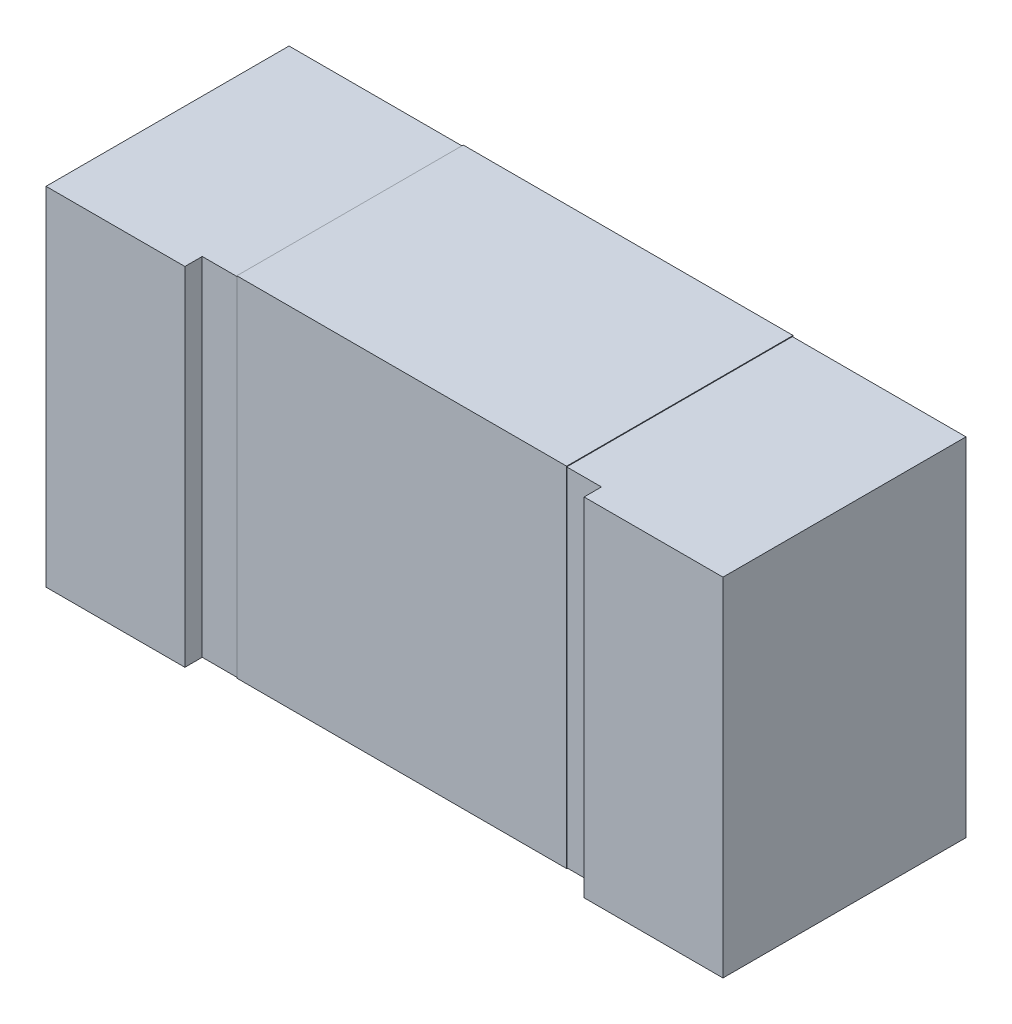
ISO-10303-21;
HEADER;
FILE_DESCRIPTION(('STEP AP214'),'2;1');
FILE_NAME('part.step','',(''),(''),'','','');
FILE_SCHEMA(('AUTOMOTIVE_DESIGN { 1 0 10303 214 1 1 1 1 }'));
ENDSEC;
DATA;
#1=APPLICATION_CONTEXT('core data for automotive mechanical design processes');
#2=APPLICATION_PROTOCOL_DEFINITION('international standard','automotive_design',2000,#1);
#3=PRODUCT_CONTEXT('',#1,'mechanical');
#4=PRODUCT('Part','Part','',(#3));
#5=PRODUCT_RELATED_PRODUCT_CATEGORY('part','',(#4));
#6=PRODUCT_DEFINITION_FORMATION('','',#4);
#7=PRODUCT_DEFINITION_CONTEXT('part definition',#1,'design');
#8=PRODUCT_DEFINITION('design','',#6,#7);
#9=PRODUCT_DEFINITION_SHAPE('','',#8);
#10=(LENGTH_UNIT() NAMED_UNIT(*) SI_UNIT(.MILLI.,.METRE.));
#11=(NAMED_UNIT(*) PLANE_ANGLE_UNIT() SI_UNIT($,.RADIAN.));
#12=(NAMED_UNIT(*) SI_UNIT($,.STERADIAN.) SOLID_ANGLE_UNIT());
#13=UNCERTAINTY_MEASURE_WITH_UNIT(LENGTH_MEASURE(1.E-05),#10,'distance_accuracy_value','');
#14=(GEOMETRIC_REPRESENTATION_CONTEXT(3) GLOBAL_UNCERTAINTY_ASSIGNED_CONTEXT((#13)) GLOBAL_UNIT_ASSIGNED_CONTEXT((#10,
#11,#12)) REPRESENTATION_CONTEXT('',''));
#15=CARTESIAN_POINT('',(0.,0.,0.));
#16=DIRECTION('',(0.,0.,1.));
#17=DIRECTION('',(1.,0.,0.));
#18=AXIS2_PLACEMENT_3D('',#15,#16,#17);
#19=CARTESIAN_POINT('',(-0.4699,-0.254,0.3302));
#20=DIRECTION('',(0.,0.,1.));
#21=DIRECTION('',(1.,0.,0.));
#22=AXIS2_PLACEMENT_3D('',#19,#20,#21);
#23=PLANE('',#22);
#24=DIRECTION('',(1.,0.,0.));
#25=VECTOR('',#24,1.);
#26=CARTESIAN_POINT('',(-0.4699,0.254,0.3302));
#27=LINE('',#26,#25);
#28=CARTESIAN_POINT('',(0.2413,0.254,0.3302));
#29=VERTEX_POINT('',#28);
#30=CARTESIAN_POINT('',(0.2921,0.254,0.3302));
#31=VERTEX_POINT('',#30);
#32=EDGE_CURVE('E228',#29,#31,#27,.T.);
#33=ORIENTED_EDGE('',*,*,#32,.F.);
#34=DIRECTION('',(0.,-1.,0.));
#35=VECTOR('',#34,1.);
#36=CARTESIAN_POINT('',(0.2413,-0.254,0.3302));
#37=LINE('',#36,#35);
#38=CARTESIAN_POINT('',(0.2413,-0.254,0.3302));
#39=VERTEX_POINT('',#38);
#40=EDGE_CURVE('E173',#29,#39,#37,.T.);
#41=ORIENTED_EDGE('',*,*,#40,.T.);
#42=DIRECTION('',(1.,0.,0.));
#43=VECTOR('',#42,1.);
#44=CARTESIAN_POINT('',(-0.4699,-0.254,0.3302));
#45=LINE('',#44,#43);
#46=CARTESIAN_POINT('',(0.2921,-0.254,0.3302));
#47=VERTEX_POINT('',#46);
#48=EDGE_CURVE('E233',#39,#47,#45,.T.);
#49=ORIENTED_EDGE('',*,*,#48,.T.);
#50=DIRECTION('',(0.,-1.,0.));
#51=VECTOR('',#50,1.);
#52=CARTESIAN_POINT('',(0.2921,0.254,0.3302));
#53=LINE('',#52,#51);
#54=EDGE_CURVE('E219',#31,#47,#53,.T.);
#55=ORIENTED_EDGE('',*,*,#54,.F.);
#56=EDGE_LOOP('',(#33,#41,#49,#55));
#57=FACE_BOUND('',#56,.T.);
#58=ADVANCED_FACE('F35',(#57),#23,.T.);
#59=CARTESIAN_POINT('',(0.,0.254,0.));
#60=DIRECTION('',(0.,-1.,0.));
#61=DIRECTION('',(0.,0.,-1.));
#62=AXIS2_PLACEMENT_3D('',#59,#60,#61);
#63=PLANE('',#62);
#64=DIRECTION('',(0.,0.,1.));
#65=VECTOR('',#64,1.);
#66=CARTESIAN_POINT('',(0.2413,0.254,0.));
#67=LINE('',#66,#65);
#68=CARTESIAN_POINT('',(0.2413,0.254,0.));
#69=VERTEX_POINT('',#68);
#70=EDGE_CURVE('E50',#69,#29,#67,.T.);
#71=ORIENTED_EDGE('',*,*,#70,.T.);
#72=ORIENTED_EDGE('',*,*,#32,.T.);
#73=DIRECTION('',(0.,0.,1.));
#74=VECTOR('',#73,1.);
#75=CARTESIAN_POINT('',(0.2921,0.254,0.3302));
#76=LINE('',#75,#74);
#77=CARTESIAN_POINT('',(0.2921,0.254,0.3556));
#78=VERTEX_POINT('',#77);
#79=EDGE_CURVE('E199',#31,#78,#76,.T.);
#80=ORIENTED_EDGE('',*,*,#79,.T.);
#81=DIRECTION('',(1.,0.,0.));
#82=VECTOR('',#81,1.);
#83=CARTESIAN_POINT('',(0.2921,0.254,0.3556));
#84=LINE('',#83,#82);
#85=CARTESIAN_POINT('',(0.4953,0.254,0.3556));
#86=VERTEX_POINT('',#85);
#87=EDGE_CURVE('E201',#78,#86,#84,.T.);
#88=ORIENTED_EDGE('',*,*,#87,.T.);
#89=DIRECTION('',(0.,0.,-1.));
#90=VECTOR('',#89,1.);
#91=CARTESIAN_POINT('',(0.4953,0.254,0.3556));
#92=LINE('',#91,#90);
#93=CARTESIAN_POINT('',(0.4953,0.254,0.));
#94=VERTEX_POINT('',#93);
#95=EDGE_CURVE('E192',#86,#94,#92,.T.);
#96=ORIENTED_EDGE('',*,*,#95,.T.);
#97=DIRECTION('',(-1.,0.,0.));
#98=VECTOR('',#97,1.);
#99=CARTESIAN_POINT('',(0.4953,0.254,0.));
#100=LINE('',#99,#98);
#101=EDGE_CURVE('E195',#94,#69,#100,.T.);
#102=ORIENTED_EDGE('',*,*,#101,.T.);
#103=EDGE_LOOP('',(#71,#72,#80,#88,#96,#102));
#104=FACE_BOUND('',#103,.T.);
#105=ADVANCED_FACE('F306',(#104),#63,.F.);
#106=CARTESIAN_POINT('',(0.,-0.254,0.));
#107=DIRECTION('',(0.,-1.,0.));
#108=DIRECTION('',(0.,0.,-1.));
#109=AXIS2_PLACEMENT_3D('',#106,#107,#108);
#110=PLANE('',#109);
#111=ORIENTED_EDGE('',*,*,#48,.F.);
#112=DIRECTION('',(0.,0.,1.));
#113=VECTOR('',#112,1.);
#114=CARTESIAN_POINT('',(0.2413,-0.254,0.));
#115=LINE('',#114,#113);
#116=CARTESIAN_POINT('',(0.2413,-0.254,0.));
#117=VERTEX_POINT('',#116);
#118=EDGE_CURVE('E209',#117,#39,#115,.T.);
#119=ORIENTED_EDGE('',*,*,#118,.F.);
#120=DIRECTION('',(-1.,0.,0.));
#121=VECTOR('',#120,1.);
#122=CARTESIAN_POINT('',(0.4953,-0.254,0.));
#123=LINE('',#122,#121);
#124=CARTESIAN_POINT('',(0.4953,-0.254,0.));
#125=VERTEX_POINT('',#124);
#126=EDGE_CURVE('E206',#125,#117,#123,.T.);
#127=ORIENTED_EDGE('',*,*,#126,.F.);
#128=DIRECTION('',(0.,0.,-1.));
#129=VECTOR('',#128,1.);
#130=CARTESIAN_POINT('',(0.4953,-0.254,0.3556));
#131=LINE('',#130,#129);
#132=CARTESIAN_POINT('',(0.4953,-0.254,0.3556));
#133=VERTEX_POINT('',#132);
#134=EDGE_CURVE('E191',#133,#125,#131,.T.);
#135=ORIENTED_EDGE('',*,*,#134,.F.);
#136=DIRECTION('',(1.,0.,0.));
#137=VECTOR('',#136,1.);
#138=CARTESIAN_POINT('',(0.2921,-0.254,0.3556));
#139=LINE('',#138,#137);
#140=CARTESIAN_POINT('',(0.2921,-0.254,0.3556));
#141=VERTEX_POINT('',#140);
#142=EDGE_CURVE('E196',#141,#133,#139,.T.);
#143=ORIENTED_EDGE('',*,*,#142,.F.);
#144=DIRECTION('',(0.,0.,1.));
#145=VECTOR('',#144,1.);
#146=CARTESIAN_POINT('',(0.2921,-0.254,0.3302));
#147=LINE('',#146,#145);
#148=EDGE_CURVE('E211',#47,#141,#147,.T.);
#149=ORIENTED_EDGE('',*,*,#148,.F.);
#150=EDGE_LOOP('',(#111,#119,#127,#135,#143,#149));
#151=FACE_BOUND('',#150,.T.);
#152=ADVANCED_FACE('F312',(#151),#110,.T.);
#153=CARTESIAN_POINT('',(0.4953,0.254,0.3556));
#154=DIRECTION('',(-1.,0.,0.));
#155=DIRECTION('',(0.,0.,1.));
#156=AXIS2_PLACEMENT_3D('',#153,#154,#155);
#157=PLANE('',#156);
#158=ORIENTED_EDGE('',*,*,#134,.T.);
#159=DIRECTION('',(0.,-1.,0.));
#160=VECTOR('',#159,1.);
#161=CARTESIAN_POINT('',(0.4953,0.254,0.));
#162=LINE('',#161,#160);
#163=EDGE_CURVE('E225',#94,#125,#162,.T.);
#164=ORIENTED_EDGE('',*,*,#163,.F.);
#165=ORIENTED_EDGE('',*,*,#95,.F.);
#166=DIRECTION('',(0.,-1.,0.));
#167=VECTOR('',#166,1.);
#168=CARTESIAN_POINT('',(0.4953,0.254,0.3556));
#169=LINE('',#168,#167);
#170=EDGE_CURVE('E203',#86,#133,#169,.T.);
#171=ORIENTED_EDGE('',*,*,#170,.T.);
#172=EDGE_LOOP('',(#158,#164,#165,#171));
#173=FACE_BOUND('',#172,.T.);
#174=ADVANCED_FACE('F328',(#173),#157,.F.);
#175=CARTESIAN_POINT('',(0.4953,0.254,0.));
#176=DIRECTION('',(0.,0.,1.));
#177=DIRECTION('',(1.,0.,0.));
#178=AXIS2_PLACEMENT_3D('',#175,#176,#177);
#179=PLANE('',#178);
#180=ORIENTED_EDGE('',*,*,#126,.T.);
#181=DIRECTION('',(0.,-1.,0.));
#182=VECTOR('',#181,1.);
#183=CARTESIAN_POINT('',(0.2413,0.254,0.));
#184=LINE('',#183,#182);
#185=EDGE_CURVE('E222',#69,#117,#184,.T.);
#186=ORIENTED_EDGE('',*,*,#185,.F.);
#187=ORIENTED_EDGE('',*,*,#101,.F.);
#188=ORIENTED_EDGE('',*,*,#163,.T.);
#189=EDGE_LOOP('',(#180,#186,#187,#188));
#190=FACE_BOUND('',#189,.T.);
#191=ADVANCED_FACE('F333',(#190),#179,.F.);
#192=CARTESIAN_POINT('',(0.2921,0.254,0.3302));
#193=DIRECTION('',(1.,0.,0.));
#194=DIRECTION('',(0.,0.,-1.));
#195=AXIS2_PLACEMENT_3D('',#192,#193,#194);
#196=PLANE('',#195);
#197=ORIENTED_EDGE('',*,*,#148,.T.);
#198=DIRECTION('',(0.,-1.,0.));
#199=VECTOR('',#198,1.);
#200=CARTESIAN_POINT('',(0.2921,0.254,0.3556));
#201=LINE('',#200,#199);
#202=EDGE_CURVE('E216',#78,#141,#201,.T.);
#203=ORIENTED_EDGE('',*,*,#202,.F.);
#204=ORIENTED_EDGE('',*,*,#79,.F.);
#205=ORIENTED_EDGE('',*,*,#54,.T.);
#206=EDGE_LOOP('',(#197,#203,#204,#205));
#207=FACE_BOUND('',#206,.T.);
#208=ADVANCED_FACE('F302',(#207),#196,.F.);
#209=CARTESIAN_POINT('',(0.2921,0.254,0.3556));
#210=DIRECTION('',(0.,0.,-1.));
#211=DIRECTION('',(-1.,0.,0.));
#212=AXIS2_PLACEMENT_3D('',#209,#210,#211);
#213=PLANE('',#212);
#214=ORIENTED_EDGE('',*,*,#142,.T.);
#215=ORIENTED_EDGE('',*,*,#170,.F.);
#216=ORIENTED_EDGE('',*,*,#87,.F.);
#217=ORIENTED_EDGE('',*,*,#202,.T.);
#218=EDGE_LOOP('',(#214,#215,#216,#217));
#219=FACE_BOUND('',#218,.T.);
#220=ADVANCED_FACE('F293',(#219),#213,.F.);
#221=CARTESIAN_POINT('',(-0.2413,0.254,0.));
#222=DIRECTION('',(-1.,0.,0.));
#223=DIRECTION('',(0.,0.,1.));
#224=AXIS2_PLACEMENT_3D('',#221,#222,#223);
#225=PLANE('',#224);
#226=DIRECTION('',(0.,0.,-1.));
#227=VECTOR('',#226,1.);
#228=CARTESIAN_POINT('',(-0.2413,0.255,-0.00099999999999994));
#229=LINE('',#228,#227);
#230=CARTESIAN_POINT('',(-0.2413,0.255,0.330359425168108));
#231=VERTEX_POINT('',#230);
#232=CARTESIAN_POINT('',(-0.2413,0.255,-0.00099999999999994));
#233=VERTEX_POINT('',#232);
#234=EDGE_CURVE('E162',#231,#233,#229,.T.);
#235=ORIENTED_EDGE('',*,*,#234,.T.);
#236=DIRECTION('',(0.,-1.,0.));
#237=VECTOR('',#236,1.);
#238=CARTESIAN_POINT('',(-0.2413,0.255,-0.00099999999999994));
#239=LINE('',#238,#237);
#240=CARTESIAN_POINT('',(-0.2413,-0.255,-0.000999999999999877));
#241=VERTEX_POINT('',#240);
#242=EDGE_CURVE('E168',#233,#241,#239,.T.);
#243=ORIENTED_EDGE('',*,*,#242,.T.);
#244=DIRECTION('',(0.,0.,1.));
#245=VECTOR('',#244,1.);
#246=CARTESIAN_POINT('',(-0.2413,-0.255,-0.000999999999999877));
#247=LINE('',#246,#245);
#248=CARTESIAN_POINT('',(-0.2413,-0.255,0.330359425168108));
#249=VERTEX_POINT('',#248);
#250=EDGE_CURVE('E172',#241,#249,#247,.T.);
#251=ORIENTED_EDGE('',*,*,#250,.T.);
#252=DIRECTION('',(0.,1.,0.));
#253=VECTOR('',#252,1.);
#254=CARTESIAN_POINT('',(-0.2413,0.255,0.330359425168108));
#255=LINE('',#254,#253);
#256=EDGE_CURVE('E152',#249,#231,#255,.T.);
#257=ORIENTED_EDGE('',*,*,#256,.T.);
#258=EDGE_LOOP('',(#235,#243,#251,#257));
#259=FACE_BOUND('',#258,.T.);
#260=DIRECTION('',(0.,0.,-1.));
#261=VECTOR('',#260,1.);
#262=CARTESIAN_POINT('',(-0.2413,0.254,0.));
#263=LINE('',#262,#261);
#264=CARTESIAN_POINT('',(-0.2413,0.254,0.3302));
#265=VERTEX_POINT('',#264);
#266=CARTESIAN_POINT('',(-0.2413,0.254,0.));
#267=VERTEX_POINT('',#266);
#268=EDGE_CURVE('E58',#265,#267,#263,.T.);
#269=ORIENTED_EDGE('',*,*,#268,.F.);
#270=DIRECTION('',(0.,-1.,0.));
#271=VECTOR('',#270,1.);
#272=CARTESIAN_POINT('',(-0.2413,-0.254,0.3302));
#273=LINE('',#272,#271);
#274=CARTESIAN_POINT('',(-0.2413,-0.254,0.3302));
#275=VERTEX_POINT('',#274);
#276=EDGE_CURVE('E176',#265,#275,#273,.T.);
#277=ORIENTED_EDGE('',*,*,#276,.T.);
#278=DIRECTION('',(0.,0.,-1.));
#279=VECTOR('',#278,1.);
#280=CARTESIAN_POINT('',(-0.2413,-0.254,0.));
#281=LINE('',#280,#279);
#282=CARTESIAN_POINT('',(-0.2413,-0.254,0.));
#283=VERTEX_POINT('',#282);
#284=EDGE_CURVE('E241',#275,#283,#281,.T.);
#285=ORIENTED_EDGE('',*,*,#284,.T.);
#286=DIRECTION('',(0.,-1.,0.));
#287=VECTOR('',#286,1.);
#288=CARTESIAN_POINT('',(-0.2413,0.254,0.));
#289=LINE('',#288,#287);
#290=EDGE_CURVE('E248',#267,#283,#289,.T.);
#291=ORIENTED_EDGE('',*,*,#290,.F.);
#292=EDGE_LOOP('',(#269,#277,#285,#291));
#293=FACE_BOUND('',#292,.T.);
#294=ADVANCED_FACE('F171',(#259,#293),#225,.T.);
#295=CARTESIAN_POINT('',(-0.849493282310598,0.255,-0.00099999999999994));
#296=DIRECTION('',(0.,0.,1.));
#297=DIRECTION('',(0.,-1.,0.));
#298=AXIS2_PLACEMENT_3D('',#295,#296,#297);
#299=PLANE('',#298);
#300=ORIENTED_EDGE('',*,*,#242,.F.);
#301=DIRECTION('',(1.,0.,0.));
#302=VECTOR('',#301,1.);
#303=CARTESIAN_POINT('',(-0.849493282310598,0.255,-0.00099999999999994));
#304=LINE('',#303,#302);
#305=CARTESIAN_POINT('',(0.2413,0.255,-0.00099999999999994));
#306=VERTEX_POINT('',#305);
#307=EDGE_CURVE('E164',#233,#306,#304,.T.);
#308=ORIENTED_EDGE('',*,*,#307,.T.);
#309=DIRECTION('',(0.,-1.,0.));
#310=VECTOR('',#309,1.);
#311=CARTESIAN_POINT('',(0.2413,0.255,-0.00099999999999994));
#312=LINE('',#311,#310);
#313=CARTESIAN_POINT('',(0.2413,-0.255,-0.000999999999999877));
#314=VERTEX_POINT('',#313);
#315=EDGE_CURVE('E180',#306,#314,#312,.T.);
#316=ORIENTED_EDGE('',*,*,#315,.T.);
#317=DIRECTION('',(1.,0.,0.));
#318=VECTOR('',#317,1.);
#319=CARTESIAN_POINT('',(-0.849493282310598,-0.255,-0.000999999999999877));
#320=LINE('',#319,#318);
#321=EDGE_CURVE('E184',#241,#314,#320,.T.);
#322=ORIENTED_EDGE('',*,*,#321,.F.);
#323=EDGE_LOOP('',(#300,#308,#316,#322));
#324=FACE_BOUND('',#323,.T.);
#325=ADVANCED_FACE('F292',(#324),#299,.F.);
#326=CARTESIAN_POINT('',(-0.849493282310598,-0.255,-0.000999999999999877));
#327=DIRECTION('',(0.,1.,0.));
#328=DIRECTION('',(0.,0.,1.));
#329=AXIS2_PLACEMENT_3D('',#326,#327,#328);
#330=PLANE('',#329);
#331=ORIENTED_EDGE('',*,*,#250,.F.);
#332=ORIENTED_EDGE('',*,*,#321,.T.);
#333=DIRECTION('',(0.,0.,1.));
#334=VECTOR('',#333,1.);
#335=CARTESIAN_POINT('',(0.2413,-0.255,-0.000999999999999877));
#336=LINE('',#335,#334);
#337=CARTESIAN_POINT('',(0.2413,-0.255,0.330359425168108));
#338=VERTEX_POINT('',#337);
#339=EDGE_CURVE('E186',#314,#338,#336,.T.);
#340=ORIENTED_EDGE('',*,*,#339,.T.);
#341=DIRECTION('',(1.,0.,0.));
#342=VECTOR('',#341,1.);
#343=CARTESIAN_POINT('',(-0.849493282310598,-0.255,0.330359425168108));
#344=LINE('',#343,#342);
#345=EDGE_CURVE('E187',#249,#338,#344,.T.);
#346=ORIENTED_EDGE('',*,*,#345,.F.);
#347=EDGE_LOOP('',(#331,#332,#340,#346));
#348=FACE_BOUND('',#347,.T.);
#349=ADVANCED_FACE('F299',(#348),#330,.F.);
#350=CARTESIAN_POINT('',(-0.849493282310598,0.255,0.330359425168108));
#351=DIRECTION('',(0.,0.,-1.));
#352=DIRECTION('',(0.,1.,0.));
#353=AXIS2_PLACEMENT_3D('',#350,#351,#352);
#354=PLANE('',#353);
#355=ORIENTED_EDGE('',*,*,#256,.F.);
#356=ORIENTED_EDGE('',*,*,#345,.T.);
#357=DIRECTION('',(0.,1.,0.));
#358=VECTOR('',#357,1.);
#359=CARTESIAN_POINT('',(0.2413,0.255,0.330359425168108));
#360=LINE('',#359,#358);
#361=CARTESIAN_POINT('',(0.2413,0.255,0.330359425168108));
#362=VERTEX_POINT('',#361);
#363=EDGE_CURVE('E155',#338,#362,#360,.T.);
#364=ORIENTED_EDGE('',*,*,#363,.T.);
#365=DIRECTION('',(1.,0.,0.));
#366=VECTOR('',#365,1.);
#367=CARTESIAN_POINT('',(-0.849493282310598,0.255,0.330359425168108));
#368=LINE('',#367,#366);
#369=EDGE_CURVE('E148',#231,#362,#368,.T.);
#370=ORIENTED_EDGE('',*,*,#369,.F.);
#371=EDGE_LOOP('',(#355,#356,#364,#370));
#372=FACE_BOUND('',#371,.T.);
#373=ADVANCED_FACE('F150',(#372),#354,.F.);
#374=CARTESIAN_POINT('',(-0.849493282310598,0.255,-0.00099999999999994));
#375=DIRECTION('',(0.,-1.,0.));
#376=DIRECTION('',(0.,0.,-1.));
#377=AXIS2_PLACEMENT_3D('',#374,#375,#376);
#378=PLANE('',#377);
#379=ORIENTED_EDGE('',*,*,#234,.F.);
#380=ORIENTED_EDGE('',*,*,#369,.T.);
#381=DIRECTION('',(0.,0.,-1.));
#382=VECTOR('',#381,1.);
#383=CARTESIAN_POINT('',(0.2413,0.255,-0.00099999999999994));
#384=LINE('',#383,#382);
#385=EDGE_CURVE('E159',#362,#306,#384,.T.);
#386=ORIENTED_EDGE('',*,*,#385,.T.);
#387=ORIENTED_EDGE('',*,*,#307,.F.);
#388=EDGE_LOOP('',(#379,#380,#386,#387));
#389=FACE_BOUND('',#388,.T.);
#390=ADVANCED_FACE('F163',(#389),#378,.F.);
#391=CARTESIAN_POINT('',(0.2413,0.,0.));
#392=DIRECTION('',(-1.,0.,0.));
#393=DIRECTION('',(0.,0.,1.));
#394=AXIS2_PLACEMENT_3D('',#391,#392,#393);
#395=PLANE('',#394);
#396=ORIENTED_EDGE('',*,*,#40,.F.);
#397=ORIENTED_EDGE('',*,*,#70,.F.);
#398=ORIENTED_EDGE('',*,*,#185,.T.);
#399=ORIENTED_EDGE('',*,*,#118,.T.);
#400=EDGE_LOOP('',(#396,#397,#398,#399));
#401=FACE_BOUND('',#400,.T.);
#402=ORIENTED_EDGE('',*,*,#315,.F.);
#403=ORIENTED_EDGE('',*,*,#385,.F.);
#404=ORIENTED_EDGE('',*,*,#363,.F.);
#405=ORIENTED_EDGE('',*,*,#339,.F.);
#406=EDGE_LOOP('',(#402,#403,#404,#405));
#407=FACE_BOUND('',#406,.T.);
#408=ADVANCED_FACE('F346',(#401,#407),#395,.F.);
#409=CARTESIAN_POINT('',(-0.4953,0.254,0.3556));
#410=DIRECTION('',(1.,0.,0.));
#411=DIRECTION('',(0.,0.,-1.));
#412=AXIS2_PLACEMENT_3D('',#409,#410,#411);
#413=PLANE('',#412);
#414=DIRECTION('',(0.,0.,1.));
#415=VECTOR('',#414,1.);
#416=CARTESIAN_POINT('',(-0.4953,-0.254,0.3556));
#417=LINE('',#416,#415);
#418=CARTESIAN_POINT('',(-0.4953,-0.254,0.));
#419=VERTEX_POINT('',#418);
#420=CARTESIAN_POINT('',(-0.4953,-0.254,0.3556));
#421=VERTEX_POINT('',#420);
#422=EDGE_CURVE('E251',#419,#421,#417,.T.);
#423=ORIENTED_EDGE('',*,*,#422,.T.);
#424=DIRECTION('',(0.,-1.,0.));
#425=VECTOR('',#424,1.);
#426=CARTESIAN_POINT('',(-0.4953,0.254,0.3556));
#427=LINE('',#426,#425);
#428=CARTESIAN_POINT('',(-0.4953,0.254,0.3556));
#429=VERTEX_POINT('',#428);
#430=EDGE_CURVE('E43',#429,#421,#427,.T.);
#431=ORIENTED_EDGE('',*,*,#430,.F.);
#432=DIRECTION('',(0.,0.,1.));
#433=VECTOR('',#432,1.);
#434=CARTESIAN_POINT('',(-0.4953,0.254,0.3556));
#435=LINE('',#434,#433);
#436=CARTESIAN_POINT('',(-0.4953,0.254,0.));
#437=VERTEX_POINT('',#436);
#438=EDGE_CURVE('E240',#437,#429,#435,.T.);
#439=ORIENTED_EDGE('',*,*,#438,.F.);
#440=DIRECTION('',(0.,-1.,0.));
#441=VECTOR('',#440,1.);
#442=CARTESIAN_POINT('',(-0.4953,0.254,0.));
#443=LINE('',#442,#441);
#444=EDGE_CURVE('E11',#437,#419,#443,.T.);
#445=ORIENTED_EDGE('',*,*,#444,.T.);
#446=EDGE_LOOP('',(#423,#431,#439,#445));
#447=FACE_BOUND('',#446,.T.);
#448=ADVANCED_FACE('F289',(#447),#413,.F.);
#449=CARTESIAN_POINT('',(-0.2921,0.254,0.3556));
#450=DIRECTION('',(0.,0.,-1.));
#451=DIRECTION('',(-1.,0.,0.));
#452=AXIS2_PLACEMENT_3D('',#449,#450,#451);
#453=PLANE('',#452);
#454=DIRECTION('',(1.,0.,0.));
#455=VECTOR('',#454,1.);
#456=CARTESIAN_POINT('',(-0.2921,-0.254,0.3556));
#457=LINE('',#456,#455);
#458=CARTESIAN_POINT('',(-0.2921,-0.254,0.3556));
#459=VERTEX_POINT('',#458);
#460=EDGE_CURVE('E253',#421,#459,#457,.T.);
#461=ORIENTED_EDGE('',*,*,#460,.T.);
#462=DIRECTION('',(0.,-1.,0.));
#463=VECTOR('',#462,1.);
#464=CARTESIAN_POINT('',(-0.2921,0.254,0.3556));
#465=LINE('',#464,#463);
#466=CARTESIAN_POINT('',(-0.2921,0.254,0.3556));
#467=VERTEX_POINT('',#466);
#468=EDGE_CURVE('E264',#467,#459,#465,.T.);
#469=ORIENTED_EDGE('',*,*,#468,.F.);
#470=DIRECTION('',(1.,0.,0.));
#471=VECTOR('',#470,1.);
#472=CARTESIAN_POINT('',(-0.2921,0.254,0.3556));
#473=LINE('',#472,#471);
#474=EDGE_CURVE('E243',#429,#467,#473,.T.);
#475=ORIENTED_EDGE('',*,*,#474,.F.);
#476=ORIENTED_EDGE('',*,*,#430,.T.);
#477=EDGE_LOOP('',(#461,#469,#475,#476));
#478=FACE_BOUND('',#477,.T.);
#479=ADVANCED_FACE('F271',(#478),#453,.F.);
#480=CARTESIAN_POINT('',(-0.2921,0.254,0.3302));
#481=DIRECTION('',(-1.,0.,0.));
#482=DIRECTION('',(0.,0.,1.));
#483=AXIS2_PLACEMENT_3D('',#480,#481,#482);
#484=PLANE('',#483);
#485=DIRECTION('',(0.,0.,-1.));
#486=VECTOR('',#485,1.);
#487=CARTESIAN_POINT('',(-0.2921,-0.254,0.3302));
#488=LINE('',#487,#486);
#489=CARTESIAN_POINT('',(-0.2921,-0.254,0.3302));
#490=VERTEX_POINT('',#489);
#491=EDGE_CURVE('E255',#459,#490,#488,.T.);
#492=ORIENTED_EDGE('',*,*,#491,.T.);
#493=DIRECTION('',(0.,-1.,0.));
#494=VECTOR('',#493,1.);
#495=CARTESIAN_POINT('',(-0.2921,0.254,0.3302));
#496=LINE('',#495,#494);
#497=CARTESIAN_POINT('',(-0.2921,0.254,0.3302));
#498=VERTEX_POINT('',#497);
#499=EDGE_CURVE('E261',#498,#490,#496,.T.);
#500=ORIENTED_EDGE('',*,*,#499,.F.);
#501=DIRECTION('',(0.,0.,-1.));
#502=VECTOR('',#501,1.);
#503=CARTESIAN_POINT('',(-0.2921,0.254,0.3302));
#504=LINE('',#503,#502);
#505=EDGE_CURVE('E245',#467,#498,#504,.T.);
#506=ORIENTED_EDGE('',*,*,#505,.F.);
#507=ORIENTED_EDGE('',*,*,#468,.T.);
#508=EDGE_LOOP('',(#492,#500,#506,#507));
#509=FACE_BOUND('',#508,.T.);
#510=ADVANCED_FACE('F280',(#509),#484,.F.);
#511=EDGE_CURVE('E234',#498,#265,#27,.T.);
#512=ORIENTED_EDGE('',*,*,#511,.T.);
#513=ORIENTED_EDGE('',*,*,#268,.T.);
#514=DIRECTION('',(-1.,0.,0.));
#515=VECTOR('',#514,1.);
#516=CARTESIAN_POINT('',(-0.4953,0.254,0.));
#517=LINE('',#516,#515);
#518=EDGE_CURVE('E237',#267,#437,#517,.T.);
#519=ORIENTED_EDGE('',*,*,#518,.T.);
#520=ORIENTED_EDGE('',*,*,#438,.T.);
#521=ORIENTED_EDGE('',*,*,#474,.T.);
#522=ORIENTED_EDGE('',*,*,#505,.T.);
#523=EDGE_LOOP('',(#512,#513,#519,#520,#521,#522));
#524=FACE_BOUND('',#523,.T.);
#525=ADVANCED_FACE('F286',(#524),#63,.F.);
#526=ORIENTED_EDGE('',*,*,#284,.F.);
#527=EDGE_CURVE('E229',#490,#275,#45,.T.);
#528=ORIENTED_EDGE('',*,*,#527,.F.);
#529=ORIENTED_EDGE('',*,*,#491,.F.);
#530=ORIENTED_EDGE('',*,*,#460,.F.);
#531=ORIENTED_EDGE('',*,*,#422,.F.);
#532=DIRECTION('',(-1.,0.,0.));
#533=VECTOR('',#532,1.);
#534=CARTESIAN_POINT('',(-0.4953,-0.254,0.));
#535=LINE('',#534,#533);
#536=EDGE_CURVE('E232',#283,#419,#535,.T.);
#537=ORIENTED_EDGE('',*,*,#536,.F.);
#538=EDGE_LOOP('',(#526,#528,#529,#530,#531,#537));
#539=FACE_BOUND('',#538,.T.);
#540=ADVANCED_FACE('F276',(#539),#110,.T.);
#541=CARTESIAN_POINT('',(-0.4953,0.254,0.));
#542=DIRECTION('',(0.,0.,1.));
#543=DIRECTION('',(1.,0.,0.));
#544=AXIS2_PLACEMENT_3D('',#541,#542,#543);
#545=PLANE('',#544);
#546=ORIENTED_EDGE('',*,*,#536,.T.);
#547=ORIENTED_EDGE('',*,*,#444,.F.);
#548=ORIENTED_EDGE('',*,*,#518,.F.);
#549=ORIENTED_EDGE('',*,*,#290,.T.);
#550=EDGE_LOOP('',(#546,#547,#548,#549));
#551=FACE_BOUND('',#550,.T.);
#552=ADVANCED_FACE('F37',(#551),#545,.F.);
#553=ORIENTED_EDGE('',*,*,#276,.F.);
#554=ORIENTED_EDGE('',*,*,#511,.F.);
#555=ORIENTED_EDGE('',*,*,#499,.T.);
#556=ORIENTED_EDGE('',*,*,#527,.T.);
#557=EDGE_LOOP('',(#553,#554,#555,#556));
#558=FACE_BOUND('',#557,.T.);
#559=ADVANCED_FACE('F284',(#558),#23,.T.);
#560=CLOSED_SHELL('',(#58,#105,#152,#174,#191,#208,#220,#294,#325,#349,#373,#390,#408,#448,#479,
#510,#525,#540,#552,#559));
#561=MANIFOLD_SOLID_BREP('B2',#560);
#562=ADVANCED_BREP_SHAPE_REPRESENTATION('',(#18,#561),#14);
#563=SHAPE_DEFINITION_REPRESENTATION(#9,#562);
ENDSEC;
END-ISO-10303-21;
